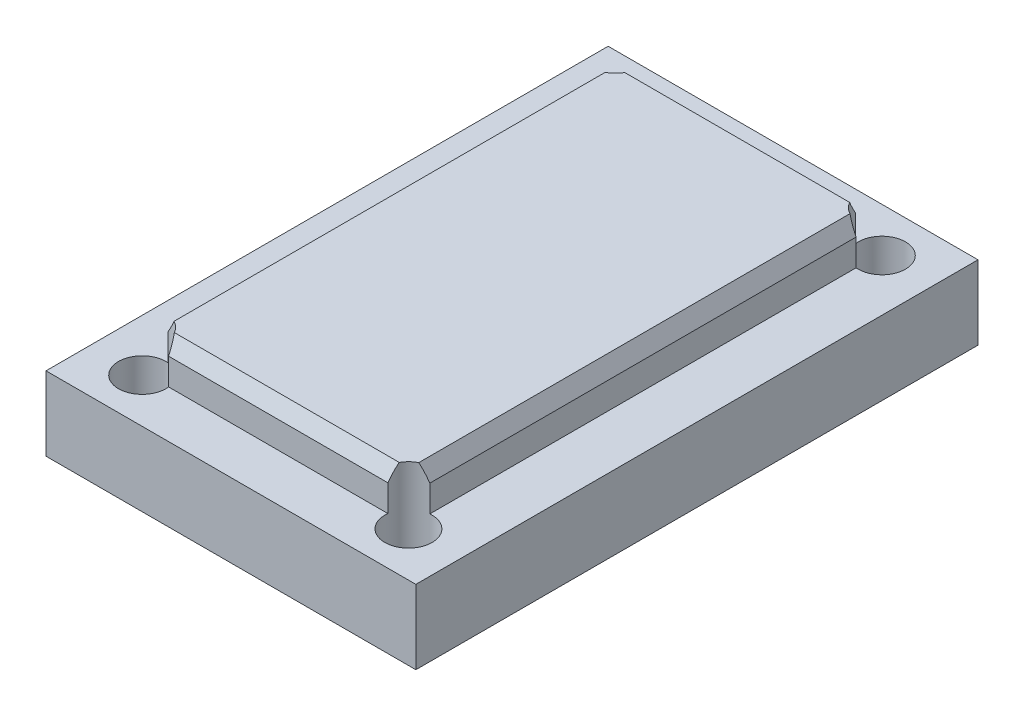
ISO-10303-21;
HEADER;
FILE_DESCRIPTION(('STEP AP214'),'2;1');
FILE_NAME('part.step','',(''),(''),'','','');
FILE_SCHEMA(('AUTOMOTIVE_DESIGN { 1 0 10303 214 1 1 1 1 }'));
ENDSEC;
DATA;
#1=APPLICATION_CONTEXT('core data for automotive mechanical design processes');
#2=APPLICATION_PROTOCOL_DEFINITION('international standard','automotive_design',2000,#1);
#3=PRODUCT_CONTEXT('',#1,'mechanical');
#4=PRODUCT('Part','Part','',(#3));
#5=PRODUCT_RELATED_PRODUCT_CATEGORY('part','',(#4));
#6=PRODUCT_DEFINITION_FORMATION('','',#4);
#7=PRODUCT_DEFINITION_CONTEXT('part definition',#1,'design');
#8=PRODUCT_DEFINITION('design','',#6,#7);
#9=PRODUCT_DEFINITION_SHAPE('','',#8);
#10=(LENGTH_UNIT() NAMED_UNIT(*) SI_UNIT(.MILLI.,.METRE.));
#11=(NAMED_UNIT(*) PLANE_ANGLE_UNIT() SI_UNIT($,.RADIAN.));
#12=(NAMED_UNIT(*) SI_UNIT($,.STERADIAN.) SOLID_ANGLE_UNIT());
#13=UNCERTAINTY_MEASURE_WITH_UNIT(LENGTH_MEASURE(1.E-05),#10,'distance_accuracy_value','');
#14=(GEOMETRIC_REPRESENTATION_CONTEXT(3) GLOBAL_UNCERTAINTY_ASSIGNED_CONTEXT((#13)) GLOBAL_UNIT_ASSIGNED_CONTEXT((#10,
#11,#12)) REPRESENTATION_CONTEXT('',''));
#15=CARTESIAN_POINT('',(0.,0.,0.));
#16=DIRECTION('',(0.,0.,1.));
#17=DIRECTION('',(1.,0.,0.));
#18=AXIS2_PLACEMENT_3D('',#15,#16,#17);
#19=CARTESIAN_POINT('',(0.,5.,0.));
#20=DIRECTION('',(0.,1.,0.));
#21=DIRECTION('',(0.,0.,1.));
#22=AXIS2_PLACEMENT_3D('',#19,#20,#21);
#23=PLANE('',#22);
#24=CARTESIAN_POINT('',(-9.,5.,16.));
#25=DIRECTION('',(0.,1.,0.));
#26=DIRECTION('',(0.,0.,1.));
#27=AXIS2_PLACEMENT_3D('',#24,#25,#26);
#28=CIRCLE('',#27,1.6);
#29=CARTESIAN_POINT('',(-8.85,5.,14.4070467677926));
#30=VERTEX_POINT('',#29);
#31=CARTESIAN_POINT('',(-7.41254921336124,5.,15.8));
#32=VERTEX_POINT('',#31);
#33=EDGE_CURVE('E283',#30,#32,#28,.T.);
#34=ORIENTED_EDGE('',*,*,#33,.F.);
#35=DIRECTION('',(0.,0.,1.));
#36=VECTOR('',#35,1.);
#37=CARTESIAN_POINT('',(-8.85,5.,-15.8));
#38=LINE('',#37,#36);
#39=CARTESIAN_POINT('',(-8.85,5.,-14.4070467677926));
#40=VERTEX_POINT('',#39);
#41=EDGE_CURVE('E300',#40,#30,#38,.T.);
#42=ORIENTED_EDGE('',*,*,#41,.F.);
#43=CARTESIAN_POINT('',(-9.,5.,-16.));
#44=DIRECTION('',(0.,1.,0.));
#45=DIRECTION('',(0.,0.,1.));
#46=AXIS2_PLACEMENT_3D('',#43,#44,#45);
#47=CIRCLE('',#46,1.6);
#48=CARTESIAN_POINT('',(-7.41254921336125,5.,-15.8));
#49=VERTEX_POINT('',#48);
#50=EDGE_CURVE('E173',#49,#40,#47,.T.);
#51=ORIENTED_EDGE('',*,*,#50,.F.);
#52=DIRECTION('',(-1.,0.,0.));
#53=VECTOR('',#52,1.);
#54=CARTESIAN_POINT('',(8.85,5.,-15.8));
#55=LINE('',#54,#53);
#56=CARTESIAN_POINT('',(7.41254921336124,5.,-15.8));
#57=VERTEX_POINT('',#56);
#58=EDGE_CURVE('E151',#57,#49,#55,.T.);
#59=ORIENTED_EDGE('',*,*,#58,.F.);
#60=CARTESIAN_POINT('',(8.99999999999999,5.,-16.));
#61=DIRECTION('',(0.,1.,0.));
#62=DIRECTION('',(0.,0.,1.));
#63=AXIS2_PLACEMENT_3D('',#60,#61,#62);
#64=CIRCLE('',#63,1.6);
#65=CARTESIAN_POINT('',(8.85,5.,-14.4070467677926));
#66=VERTEX_POINT('',#65);
#67=EDGE_CURVE('E156',#66,#57,#64,.T.);
#68=ORIENTED_EDGE('',*,*,#67,.F.);
#69=DIRECTION('',(0.,0.,-1.));
#70=VECTOR('',#69,1.);
#71=CARTESIAN_POINT('',(8.85,5.,-15.8));
#72=LINE('',#71,#70);
#73=CARTESIAN_POINT('',(8.85,5.,14.4070467677926));
#74=VERTEX_POINT('',#73);
#75=EDGE_CURVE('E175',#74,#66,#72,.T.);
#76=ORIENTED_EDGE('',*,*,#75,.F.);
#77=CARTESIAN_POINT('',(9.,5.,16.));
#78=DIRECTION('',(0.,1.,0.));
#79=DIRECTION('',(0.,0.,1.));
#80=AXIS2_PLACEMENT_3D('',#77,#78,#79);
#81=CIRCLE('',#80,1.6);
#82=CARTESIAN_POINT('',(7.41254921336124,5.,15.8));
#83=VERTEX_POINT('',#82);
#84=EDGE_CURVE('E295',#83,#74,#81,.T.);
#85=ORIENTED_EDGE('',*,*,#84,.F.);
#86=DIRECTION('',(1.,0.,0.));
#87=VECTOR('',#86,1.);
#88=CARTESIAN_POINT('',(8.85,5.,15.8));
#89=LINE('',#88,#87);
#90=EDGE_CURVE('E180',#32,#83,#89,.T.);
#91=ORIENTED_EDGE('',*,*,#90,.F.);
#92=EDGE_LOOP('',(#34,#42,#51,#59,#68,#76,#85,#91));
#93=FACE_BOUND('',#92,.T.);
#94=DIRECTION('',(0.,0.,1.));
#95=VECTOR('',#94,1.);
#96=CARTESIAN_POINT('',(-12.5,5.,19.));
#97=LINE('',#96,#95);
#98=CARTESIAN_POINT('',(-12.5,5.,-19.));
#99=VERTEX_POINT('',#98);
#100=CARTESIAN_POINT('',(-12.5,5.,19.));
#101=VERTEX_POINT('',#100);
#102=EDGE_CURVE('E184',#99,#101,#97,.T.);
#103=ORIENTED_EDGE('',*,*,#102,.T.);
#104=DIRECTION('',(1.,0.,0.));
#105=VECTOR('',#104,1.);
#106=CARTESIAN_POINT('',(12.5,5.,19.));
#107=LINE('',#106,#105);
#108=CARTESIAN_POINT('',(12.5,5.,19.));
#109=VERTEX_POINT('',#108);
#110=EDGE_CURVE('E187',#101,#109,#107,.T.);
#111=ORIENTED_EDGE('',*,*,#110,.T.);
#112=DIRECTION('',(0.,0.,-1.));
#113=VECTOR('',#112,1.);
#114=CARTESIAN_POINT('',(12.5,5.,19.));
#115=LINE('',#114,#113);
#116=CARTESIAN_POINT('',(12.5,5.,-19.));
#117=VERTEX_POINT('',#116);
#118=EDGE_CURVE('E190',#109,#117,#115,.T.);
#119=ORIENTED_EDGE('',*,*,#118,.T.);
#120=DIRECTION('',(-1.,0.,0.));
#121=VECTOR('',#120,1.);
#122=CARTESIAN_POINT('',(12.5,5.,-19.));
#123=LINE('',#122,#121);
#124=EDGE_CURVE('E192',#117,#99,#123,.T.);
#125=ORIENTED_EDGE('',*,*,#124,.T.);
#126=EDGE_LOOP('',(#103,#111,#119,#125));
#127=FACE_BOUND('',#126,.T.);
#128=ADVANCED_FACE('F34',(#93,#127),#23,.T.);
#129=CARTESIAN_POINT('',(-12.5,5.,19.));
#130=DIRECTION('',(1.,0.,0.));
#131=DIRECTION('',(0.,0.,-1.));
#132=AXIS2_PLACEMENT_3D('',#129,#130,#131);
#133=PLANE('',#132);
#134=DIRECTION('',(0.,0.,1.));
#135=VECTOR('',#134,1.);
#136=CARTESIAN_POINT('',(-12.5,0.,19.));
#137=LINE('',#136,#135);
#138=CARTESIAN_POINT('',(-12.5,0.,-19.));
#139=VERTEX_POINT('',#138);
#140=CARTESIAN_POINT('',(-12.5,0.,19.));
#141=VERTEX_POINT('',#140);
#142=EDGE_CURVE('E174',#139,#141,#137,.T.);
#143=ORIENTED_EDGE('',*,*,#142,.T.);
#144=DIRECTION('',(0.,-1.,0.));
#145=VECTOR('',#144,1.);
#146=CARTESIAN_POINT('',(-12.5,5.,19.));
#147=LINE('',#146,#145);
#148=EDGE_CURVE('E207',#101,#141,#147,.T.);
#149=ORIENTED_EDGE('',*,*,#148,.F.);
#150=ORIENTED_EDGE('',*,*,#102,.F.);
#151=DIRECTION('',(0.,-1.,0.));
#152=VECTOR('',#151,1.);
#153=CARTESIAN_POINT('',(-12.5,5.,-19.));
#154=LINE('',#153,#152);
#155=EDGE_CURVE('E193',#99,#139,#154,.T.);
#156=ORIENTED_EDGE('',*,*,#155,.T.);
#157=EDGE_LOOP('',(#143,#149,#150,#156));
#158=FACE_BOUND('',#157,.T.);
#159=ADVANCED_FACE('F327',(#158),#133,.F.);
#160=CARTESIAN_POINT('',(12.5,5.,19.));
#161=DIRECTION('',(0.,0.,-1.));
#162=DIRECTION('',(-1.,0.,0.));
#163=AXIS2_PLACEMENT_3D('',#160,#161,#162);
#164=PLANE('',#163);
#165=DIRECTION('',(1.,0.,0.));
#166=VECTOR('',#165,1.);
#167=CARTESIAN_POINT('',(12.5,0.,19.));
#168=LINE('',#167,#166);
#169=CARTESIAN_POINT('',(12.5,0.,19.));
#170=VERTEX_POINT('',#169);
#171=EDGE_CURVE('E178',#141,#170,#168,.T.);
#172=ORIENTED_EDGE('',*,*,#171,.T.);
#173=DIRECTION('',(0.,-1.,0.));
#174=VECTOR('',#173,1.);
#175=CARTESIAN_POINT('',(12.5,5.,19.));
#176=LINE('',#175,#174);
#177=EDGE_CURVE('E204',#109,#170,#176,.T.);
#178=ORIENTED_EDGE('',*,*,#177,.F.);
#179=ORIENTED_EDGE('',*,*,#110,.F.);
#180=ORIENTED_EDGE('',*,*,#148,.T.);
#181=EDGE_LOOP('',(#172,#178,#179,#180));
#182=FACE_BOUND('',#181,.T.);
#183=ADVANCED_FACE('F332',(#182),#164,.F.);
#184=CARTESIAN_POINT('',(12.5,5.,19.));
#185=DIRECTION('',(-1.,0.,0.));
#186=DIRECTION('',(0.,0.,1.));
#187=AXIS2_PLACEMENT_3D('',#184,#185,#186);
#188=PLANE('',#187);
#189=DIRECTION('',(0.,0.,-1.));
#190=VECTOR('',#189,1.);
#191=CARTESIAN_POINT('',(12.5,0.,19.));
#192=LINE('',#191,#190);
#193=CARTESIAN_POINT('',(12.5,0.,-19.));
#194=VERTEX_POINT('',#193);
#195=EDGE_CURVE('E196',#170,#194,#192,.T.);
#196=ORIENTED_EDGE('',*,*,#195,.T.);
#197=DIRECTION('',(0.,-1.,0.));
#198=VECTOR('',#197,1.);
#199=CARTESIAN_POINT('',(12.5,5.,-19.));
#200=LINE('',#199,#198);
#201=EDGE_CURVE('E201',#117,#194,#200,.T.);
#202=ORIENTED_EDGE('',*,*,#201,.F.);
#203=ORIENTED_EDGE('',*,*,#118,.F.);
#204=ORIENTED_EDGE('',*,*,#177,.T.);
#205=EDGE_LOOP('',(#196,#202,#203,#204));
#206=FACE_BOUND('',#205,.T.);
#207=ADVANCED_FACE('F345',(#206),#188,.F.);
#208=CARTESIAN_POINT('',(12.5,5.,-19.));
#209=DIRECTION('',(0.,0.,1.));
#210=DIRECTION('',(1.,0.,0.));
#211=AXIS2_PLACEMENT_3D('',#208,#209,#210);
#212=PLANE('',#211);
#213=DIRECTION('',(-1.,0.,0.));
#214=VECTOR('',#213,1.);
#215=CARTESIAN_POINT('',(12.5,0.,-19.));
#216=LINE('',#215,#214);
#217=EDGE_CURVE('E188',#194,#139,#216,.T.);
#218=ORIENTED_EDGE('',*,*,#217,.T.);
#219=ORIENTED_EDGE('',*,*,#155,.F.);
#220=ORIENTED_EDGE('',*,*,#124,.F.);
#221=ORIENTED_EDGE('',*,*,#201,.T.);
#222=EDGE_LOOP('',(#218,#219,#220,#221));
#223=FACE_BOUND('',#222,.T.);
#224=ADVANCED_FACE('F341',(#223),#212,.F.);
#225=CARTESIAN_POINT('',(0.,0.,0.));
#226=DIRECTION('',(0.,1.,0.));
#227=DIRECTION('',(0.,0.,1.));
#228=AXIS2_PLACEMENT_3D('',#225,#226,#227);
#229=PLANE('',#228);
#230=CARTESIAN_POINT('',(-9.,0.,16.));
#231=DIRECTION('',(0.,1.,0.));
#232=DIRECTION('',(0.,0.,1.));
#233=AXIS2_PLACEMENT_3D('',#230,#231,#232);
#234=CIRCLE('',#233,1.6);
#235=CARTESIAN_POINT('',(-9.,0.,17.6));
#236=VERTEX_POINT('',#235);
#237=EDGE_CURVE('E157',#236,#236,#234,.T.);
#238=ORIENTED_EDGE('',*,*,#237,.T.);
#239=EDGE_LOOP('',(#238));
#240=FACE_BOUND('',#239,.T.);
#241=CARTESIAN_POINT('',(-9.,0.,-16.));
#242=DIRECTION('',(0.,1.,0.));
#243=DIRECTION('',(0.,0.,1.));
#244=AXIS2_PLACEMENT_3D('',#241,#242,#243);
#245=CIRCLE('',#244,1.6);
#246=CARTESIAN_POINT('',(-9.,0.,-14.4));
#247=VERTEX_POINT('',#246);
#248=EDGE_CURVE('E265',#247,#247,#245,.T.);
#249=ORIENTED_EDGE('',*,*,#248,.T.);
#250=EDGE_LOOP('',(#249));
#251=FACE_BOUND('',#250,.T.);
#252=CARTESIAN_POINT('',(8.99999999999999,0.,-16.));
#253=DIRECTION('',(0.,1.,0.));
#254=DIRECTION('',(0.,0.,1.));
#255=AXIS2_PLACEMENT_3D('',#252,#253,#254);
#256=CIRCLE('',#255,1.6);
#257=CARTESIAN_POINT('',(8.99999999999999,0.,-14.4));
#258=VERTEX_POINT('',#257);
#259=EDGE_CURVE('E272',#258,#258,#256,.T.);
#260=ORIENTED_EDGE('',*,*,#259,.T.);
#261=EDGE_LOOP('',(#260));
#262=FACE_BOUND('',#261,.T.);
#263=CARTESIAN_POINT('',(9.,0.,16.));
#264=DIRECTION('',(0.,1.,0.));
#265=DIRECTION('',(0.,0.,1.));
#266=AXIS2_PLACEMENT_3D('',#263,#264,#265);
#267=CIRCLE('',#266,1.6);
#268=CARTESIAN_POINT('',(9.,0.,17.6));
#269=VERTEX_POINT('',#268);
#270=EDGE_CURVE('E290',#269,#269,#267,.T.);
#271=ORIENTED_EDGE('',*,*,#270,.T.);
#272=EDGE_LOOP('',(#271));
#273=FACE_BOUND('',#272,.T.);
#274=ORIENTED_EDGE('',*,*,#142,.F.);
#275=ORIENTED_EDGE('',*,*,#217,.F.);
#276=ORIENTED_EDGE('',*,*,#195,.F.);
#277=ORIENTED_EDGE('',*,*,#171,.F.);
#278=EDGE_LOOP('',(#274,#275,#276,#277));
#279=FACE_BOUND('',#278,.T.);
#280=ADVANCED_FACE('F338',(#240,#251,#262,#273,#279),#229,.F.);
#281=CARTESIAN_POINT('',(-8.85,7.8,-15.8));
#282=DIRECTION('',(1.,0.,0.));
#283=DIRECTION('',(0.,0.,-1.));
#284=AXIS2_PLACEMENT_3D('',#281,#282,#283);
#285=PLANE('',#284);
#286=DIRECTION('',(0.,1.,0.));
#287=VECTOR('',#286,1.);
#288=CARTESIAN_POINT('',(-8.85,0.,14.4070467677926));
#289=LINE('',#288,#287);
#290=CARTESIAN_POINT('',(-8.85,6.79999999999999,14.4070467677926));
#291=VERTEX_POINT('',#290);
#292=EDGE_CURVE('E245',#30,#291,#289,.T.);
#293=ORIENTED_EDGE('',*,*,#292,.T.);
#294=DIRECTION('',(0.,0.,-1.));
#295=VECTOR('',#294,1.);
#296=CARTESIAN_POINT('',(-8.85,6.79999999999999,-15.8));
#297=LINE('',#296,#295);
#298=CARTESIAN_POINT('',(-8.85,6.79999999999999,-14.4070467677926));
#299=VERTEX_POINT('',#298);
#300=EDGE_CURVE('E42',#291,#299,#297,.T.);
#301=ORIENTED_EDGE('',*,*,#300,.T.);
#302=DIRECTION('',(0.,1.,0.));
#303=VECTOR('',#302,1.);
#304=CARTESIAN_POINT('',(-8.85,0.,-14.4070467677926));
#305=LINE('',#304,#303);
#306=EDGE_CURVE('E244',#299,#40,#305,.F.);
#307=ORIENTED_EDGE('',*,*,#306,.T.);
#308=ORIENTED_EDGE('',*,*,#41,.T.);
#309=EDGE_LOOP('',(#293,#301,#307,#308));
#310=FACE_BOUND('',#309,.T.);
#311=ADVANCED_FACE('F242',(#310),#285,.F.);
#312=CARTESIAN_POINT('',(8.85,7.8,15.8));
#313=DIRECTION('',(0.,0.,-1.));
#314=DIRECTION('',(-1.,0.,0.));
#315=AXIS2_PLACEMENT_3D('',#312,#313,#314);
#316=PLANE('',#315);
#317=DIRECTION('',(0.,1.,0.));
#318=VECTOR('',#317,1.);
#319=CARTESIAN_POINT('',(7.41254921336124,0.,15.8));
#320=LINE('',#319,#318);
#321=CARTESIAN_POINT('',(7.41254921336124,6.8,15.8));
#322=VERTEX_POINT('',#321);
#323=EDGE_CURVE('E298',#83,#322,#320,.T.);
#324=ORIENTED_EDGE('',*,*,#323,.T.);
#325=DIRECTION('',(-1.,0.,0.));
#326=VECTOR('',#325,1.);
#327=CARTESIAN_POINT('',(8.85,6.8,15.8));
#328=LINE('',#327,#326);
#329=CARTESIAN_POINT('',(-7.41254921336124,6.8,15.8));
#330=VERTEX_POINT('',#329);
#331=EDGE_CURVE('E11',#322,#330,#328,.T.);
#332=ORIENTED_EDGE('',*,*,#331,.T.);
#333=DIRECTION('',(0.,1.,0.));
#334=VECTOR('',#333,1.);
#335=CARTESIAN_POINT('',(-7.41254921336124,0.,15.8));
#336=LINE('',#335,#334);
#337=EDGE_CURVE('E252',#330,#32,#336,.F.);
#338=ORIENTED_EDGE('',*,*,#337,.T.);
#339=ORIENTED_EDGE('',*,*,#90,.T.);
#340=EDGE_LOOP('',(#324,#332,#338,#339));
#341=FACE_BOUND('',#340,.T.);
#342=ADVANCED_FACE('F303',(#341),#316,.F.);
#343=CARTESIAN_POINT('',(8.85,7.8,-15.8));
#344=DIRECTION('',(-1.,0.,0.));
#345=DIRECTION('',(0.,0.,1.));
#346=AXIS2_PLACEMENT_3D('',#343,#344,#345);
#347=PLANE('',#346);
#348=DIRECTION('',(0.,1.,0.));
#349=VECTOR('',#348,1.);
#350=CARTESIAN_POINT('',(8.85,0.,-14.4070467677926));
#351=LINE('',#350,#349);
#352=CARTESIAN_POINT('',(8.85,6.8,-14.4070467677926));
#353=VERTEX_POINT('',#352);
#354=EDGE_CURVE('E163',#66,#353,#351,.T.);
#355=ORIENTED_EDGE('',*,*,#354,.T.);
#356=DIRECTION('',(0.,0.,1.));
#357=VECTOR('',#356,1.);
#358=CARTESIAN_POINT('',(8.85,6.8,-15.8));
#359=LINE('',#358,#357);
#360=CARTESIAN_POINT('',(8.85,6.8,14.4070467677926));
#361=VERTEX_POINT('',#360);
#362=EDGE_CURVE('E226',#353,#361,#359,.T.);
#363=ORIENTED_EDGE('',*,*,#362,.T.);
#364=DIRECTION('',(0.,1.,0.));
#365=VECTOR('',#364,1.);
#366=CARTESIAN_POINT('',(8.85,0.,14.4070467677926));
#367=LINE('',#366,#365);
#368=EDGE_CURVE('E293',#361,#74,#367,.F.);
#369=ORIENTED_EDGE('',*,*,#368,.T.);
#370=ORIENTED_EDGE('',*,*,#75,.T.);
#371=EDGE_LOOP('',(#355,#363,#369,#370));
#372=FACE_BOUND('',#371,.T.);
#373=ADVANCED_FACE('F309',(#372),#347,.F.);
#374=CARTESIAN_POINT('',(8.85,7.8,-15.8));
#375=DIRECTION('',(0.,0.,1.));
#376=DIRECTION('',(1.,0.,0.));
#377=AXIS2_PLACEMENT_3D('',#374,#375,#376);
#378=PLANE('',#377);
#379=DIRECTION('',(0.,1.,0.));
#380=VECTOR('',#379,1.);
#381=CARTESIAN_POINT('',(-7.41254921336125,0.,-15.8));
#382=LINE('',#381,#380);
#383=CARTESIAN_POINT('',(-7.41254921336125,6.8,-15.8));
#384=VERTEX_POINT('',#383);
#385=EDGE_CURVE('E279',#49,#384,#382,.T.);
#386=ORIENTED_EDGE('',*,*,#385,.T.);
#387=DIRECTION('',(1.,0.,0.));
#388=VECTOR('',#387,1.);
#389=CARTESIAN_POINT('',(8.85,6.8,-15.8));
#390=LINE('',#389,#388);
#391=CARTESIAN_POINT('',(7.41254921336124,6.8,-15.8));
#392=VERTEX_POINT('',#391);
#393=EDGE_CURVE('E153',#384,#392,#390,.T.);
#394=ORIENTED_EDGE('',*,*,#393,.T.);
#395=DIRECTION('',(0.,1.,0.));
#396=VECTOR('',#395,1.);
#397=CARTESIAN_POINT('',(7.41254921336124,0.,-15.8));
#398=LINE('',#397,#396);
#399=EDGE_CURVE('E146',#392,#57,#398,.F.);
#400=ORIENTED_EDGE('',*,*,#399,.T.);
#401=ORIENTED_EDGE('',*,*,#58,.T.);
#402=EDGE_LOOP('',(#386,#394,#400,#401));
#403=FACE_BOUND('',#402,.T.);
#404=ADVANCED_FACE('F149',(#403),#378,.F.);
#405=CARTESIAN_POINT('',(0.,7.8,0.));
#406=DIRECTION('',(0.,-1.,0.));
#407=DIRECTION('',(0.,0.,-1.));
#408=AXIS2_PLACEMENT_3D('',#405,#406,#407);
#409=PLANE('',#408);
#410=CARTESIAN_POINT('',(9.,7.8,16.));
#411=DIRECTION('',(0.,1.,0.));
#412=DIRECTION('',(0.,0.,1.));
#413=AXIS2_PLACEMENT_3D('',#410,#411,#412);
#414=CIRCLE('',#413,1.6);
#415=CARTESIAN_POINT('',(8.27264973081038,7.8,14.5748819045743));
#416=VERTEX_POINT('',#415);
#417=CARTESIAN_POINT('',(7.60152706175956,7.8,15.2226497308104));
#418=VERTEX_POINT('',#417);
#419=EDGE_CURVE('E287',#416,#418,#414,.T.);
#420=ORIENTED_EDGE('',*,*,#419,.F.);
#421=DIRECTION('',(0.,0.,-1.));
#422=VECTOR('',#421,1.);
#423=CARTESIAN_POINT('',(8.27264973081038,7.8,0.));
#424=LINE('',#423,#422);
#425=CARTESIAN_POINT('',(8.27264973081037,7.8,-14.5748819045743));
#426=VERTEX_POINT('',#425);
#427=EDGE_CURVE('E219',#416,#426,#424,.T.);
#428=ORIENTED_EDGE('',*,*,#427,.T.);
#429=CARTESIAN_POINT('',(8.99999999999999,7.8,-16.));
#430=DIRECTION('',(0.,1.,0.));
#431=DIRECTION('',(0.,0.,1.));
#432=AXIS2_PLACEMENT_3D('',#429,#430,#431);
#433=CIRCLE('',#432,1.6);
#434=CARTESIAN_POINT('',(7.60152706175957,7.8,-15.2226497308104));
#435=VERTEX_POINT('',#434);
#436=EDGE_CURVE('E274',#435,#426,#433,.T.);
#437=ORIENTED_EDGE('',*,*,#436,.F.);
#438=DIRECTION('',(-1.,0.,0.));
#439=VECTOR('',#438,1.);
#440=CARTESIAN_POINT('',(0.,7.8,-15.2226497308104));
#441=LINE('',#440,#439);
#442=CARTESIAN_POINT('',(-7.60152706175957,7.8,-15.2226497308104));
#443=VERTEX_POINT('',#442);
#444=EDGE_CURVE('E216',#435,#443,#441,.T.);
#445=ORIENTED_EDGE('',*,*,#444,.T.);
#446=CARTESIAN_POINT('',(-9.,7.8,-16.));
#447=DIRECTION('',(0.,1.,0.));
#448=DIRECTION('',(0.,0.,1.));
#449=AXIS2_PLACEMENT_3D('',#446,#447,#448);
#450=CIRCLE('',#449,1.6);
#451=CARTESIAN_POINT('',(-8.27264973081037,7.8,-14.5748819045743));
#452=VERTEX_POINT('',#451);
#453=EDGE_CURVE('E262',#452,#443,#450,.T.);
#454=ORIENTED_EDGE('',*,*,#453,.F.);
#455=DIRECTION('',(0.,0.,1.));
#456=VECTOR('',#455,1.);
#457=CARTESIAN_POINT('',(-8.27264973081037,7.8,0.));
#458=LINE('',#457,#456);
#459=CARTESIAN_POINT('',(-8.27264973081037,7.8,14.5748819045743));
#460=VERTEX_POINT('',#459);
#461=EDGE_CURVE('E213',#452,#460,#458,.T.);
#462=ORIENTED_EDGE('',*,*,#461,.T.);
#463=CARTESIAN_POINT('',(-9.,7.8,16.));
#464=DIRECTION('',(0.,1.,0.));
#465=DIRECTION('',(0.,0.,1.));
#466=AXIS2_PLACEMENT_3D('',#463,#464,#465);
#467=CIRCLE('',#466,1.6);
#468=CARTESIAN_POINT('',(-7.60152706175956,7.8,15.2226497308104));
#469=VERTEX_POINT('',#468);
#470=EDGE_CURVE('E260',#469,#460,#467,.T.);
#471=ORIENTED_EDGE('',*,*,#470,.F.);
#472=DIRECTION('',(1.,0.,0.));
#473=VECTOR('',#472,1.);
#474=CARTESIAN_POINT('',(0.,7.8,15.2226497308104));
#475=LINE('',#474,#473);
#476=EDGE_CURVE('E210',#469,#418,#475,.T.);
#477=ORIENTED_EDGE('',*,*,#476,.T.);
#478=EDGE_LOOP('',(#420,#428,#437,#445,#454,#462,#471,#477));
#479=FACE_BOUND('',#478,.T.);
#480=ADVANCED_FACE('F259',(#479),#409,.F.);
#481=CARTESIAN_POINT('',(9.,0.,16.));
#482=DIRECTION('',(0.,1.,0.));
#483=DIRECTION('',(0.,0.,1.));
#484=AXIS2_PLACEMENT_3D('',#481,#482,#483);
#485=CYLINDRICAL_SURFACE('',#484,1.6);
#486=ORIENTED_EDGE('',*,*,#270,.F.);
#487=EDGE_LOOP('',(#486));
#488=FACE_BOUND('',#487,.T.);
#489=ORIENTED_EDGE('',*,*,#368,.F.);
#490=CARTESIAN_POINT('',(9.,6.54019237886467,16.));
#491=DIRECTION('',(-0.86602540378444,-0.499999999999998,0.));
#492=DIRECTION('',(-0.499999999999998,0.86602540378444,0.));
#493=AXIS2_PLACEMENT_3D('',#490,#491,#492);
#494=ELLIPSE('',#493,3.20000000000002,1.6);
#495=EDGE_CURVE('E230',#361,#416,#494,.F.);
#496=ORIENTED_EDGE('',*,*,#495,.T.);
#497=ORIENTED_EDGE('',*,*,#419,.T.);
#498=CARTESIAN_POINT('',(9.,6.45358983848623,16.));
#499=DIRECTION('',(0.,-0.499999999999998,-0.86602540378444));
#500=DIRECTION('',(0.,0.86602540378444,-0.499999999999998));
#501=AXIS2_PLACEMENT_3D('',#498,#499,#500);
#502=ELLIPSE('',#501,3.20000000000002,1.6);
#503=EDGE_CURVE('E228',#418,#322,#502,.F.);
#504=ORIENTED_EDGE('',*,*,#503,.T.);
#505=ORIENTED_EDGE('',*,*,#323,.F.);
#506=ORIENTED_EDGE('',*,*,#84,.T.);
#507=EDGE_LOOP('',(#489,#496,#497,#504,#505,#506));
#508=FACE_BOUND('',#507,.T.);
#509=ADVANCED_FACE('F307',(#488,#508),#485,.F.);
#510=CARTESIAN_POINT('',(8.99999999999999,0.,-16.));
#511=DIRECTION('',(0.,1.,0.));
#512=DIRECTION('',(0.,0.,1.));
#513=AXIS2_PLACEMENT_3D('',#510,#511,#512);
#514=CYLINDRICAL_SURFACE('',#513,1.6);
#515=ORIENTED_EDGE('',*,*,#259,.F.);
#516=EDGE_LOOP('',(#515));
#517=FACE_BOUND('',#516,.T.);
#518=ORIENTED_EDGE('',*,*,#436,.T.);
#519=CARTESIAN_POINT('',(8.99999999999999,6.54019237886467,-16.));
#520=DIRECTION('',(-0.86602540378444,-0.499999999999998,0.));
#521=DIRECTION('',(-0.499999999999998,0.86602540378444,0.));
#522=AXIS2_PLACEMENT_3D('',#519,#520,#521);
#523=ELLIPSE('',#522,3.20000000000002,1.6);
#524=EDGE_CURVE('E224',#426,#353,#523,.F.);
#525=ORIENTED_EDGE('',*,*,#524,.T.);
#526=ORIENTED_EDGE('',*,*,#354,.F.);
#527=ORIENTED_EDGE('',*,*,#67,.T.);
#528=ORIENTED_EDGE('',*,*,#399,.F.);
#529=CARTESIAN_POINT('',(8.99999999999999,6.45358983848622,-16.));
#530=DIRECTION('',(0.,-0.5,0.866025403784439));
#531=DIRECTION('',(0.,0.866025403784439,0.5));
#532=AXIS2_PLACEMENT_3D('',#529,#530,#531);
#533=ELLIPSE('',#532,3.2,1.6);
#534=EDGE_CURVE('E222',#392,#435,#533,.F.);
#535=ORIENTED_EDGE('',*,*,#534,.T.);
#536=EDGE_LOOP('',(#518,#525,#526,#527,#528,#535));
#537=FACE_BOUND('',#536,.T.);
#538=ADVANCED_FACE('F161',(#517,#537),#514,.F.);
#539=CARTESIAN_POINT('',(-9.,0.,-16.));
#540=DIRECTION('',(0.,1.,0.));
#541=DIRECTION('',(0.,0.,1.));
#542=AXIS2_PLACEMENT_3D('',#539,#540,#541);
#543=CYLINDRICAL_SURFACE('',#542,1.6);
#544=ORIENTED_EDGE('',*,*,#248,.F.);
#545=EDGE_LOOP('',(#544));
#546=FACE_BOUND('',#545,.T.);
#547=ORIENTED_EDGE('',*,*,#453,.T.);
#548=CARTESIAN_POINT('',(-9.,6.45358983848621,-16.));
#549=DIRECTION('',(0.,-0.5,0.866025403784439));
#550=DIRECTION('',(0.,0.866025403784439,0.5));
#551=AXIS2_PLACEMENT_3D('',#548,#549,#550);
#552=ELLIPSE('',#551,3.2,1.6);
#553=EDGE_CURVE('E234',#443,#384,#552,.F.);
#554=ORIENTED_EDGE('',*,*,#553,.T.);
#555=ORIENTED_EDGE('',*,*,#385,.F.);
#556=ORIENTED_EDGE('',*,*,#50,.T.);
#557=ORIENTED_EDGE('',*,*,#306,.F.);
#558=CARTESIAN_POINT('',(-9.,6.54019237886466,-16.));
#559=DIRECTION('',(0.866025403784439,-0.5,0.));
#560=DIRECTION('',(0.5,0.866025403784439,0.));
#561=AXIS2_PLACEMENT_3D('',#558,#559,#560);
#562=ELLIPSE('',#561,3.20000000000001,1.6);
#563=EDGE_CURVE('E232',#299,#452,#562,.F.);
#564=ORIENTED_EDGE('',*,*,#563,.T.);
#565=EDGE_LOOP('',(#547,#554,#555,#556,#557,#564));
#566=FACE_BOUND('',#565,.T.);
#567=ADVANCED_FACE('F250',(#546,#566),#543,.F.);
#568=CARTESIAN_POINT('',(-9.,0.,16.));
#569=DIRECTION('',(0.,1.,0.));
#570=DIRECTION('',(0.,0.,1.));
#571=AXIS2_PLACEMENT_3D('',#568,#569,#570);
#572=CYLINDRICAL_SURFACE('',#571,1.6);
#573=ORIENTED_EDGE('',*,*,#237,.F.);
#574=EDGE_LOOP('',(#573));
#575=FACE_BOUND('',#574,.T.);
#576=ORIENTED_EDGE('',*,*,#470,.T.);
#577=CARTESIAN_POINT('',(-9.,6.54019237886466,16.));
#578=DIRECTION('',(0.866025403784439,-0.5,0.));
#579=DIRECTION('',(0.5,0.866025403784439,0.));
#580=AXIS2_PLACEMENT_3D('',#577,#578,#579);
#581=ELLIPSE('',#580,3.20000000000001,1.6);
#582=EDGE_CURVE('E49',#460,#291,#581,.F.);
#583=ORIENTED_EDGE('',*,*,#582,.T.);
#584=ORIENTED_EDGE('',*,*,#292,.F.);
#585=ORIENTED_EDGE('',*,*,#33,.T.);
#586=ORIENTED_EDGE('',*,*,#337,.F.);
#587=CARTESIAN_POINT('',(-9.,6.45358983848624,16.));
#588=DIRECTION('',(0.,-0.499999999999998,-0.86602540378444));
#589=DIRECTION('',(0.,0.86602540378444,-0.499999999999998));
#590=AXIS2_PLACEMENT_3D('',#587,#588,#589);
#591=ELLIPSE('',#590,3.20000000000002,1.6);
#592=EDGE_CURVE('E237',#330,#469,#591,.F.);
#593=ORIENTED_EDGE('',*,*,#592,.T.);
#594=EDGE_LOOP('',(#576,#583,#584,#585,#586,#593));
#595=FACE_BOUND('',#594,.T.);
#596=ADVANCED_FACE('F263',(#575,#595),#572,.F.);
#597=CARTESIAN_POINT('',(8.27264973081038,7.8,0.));
#598=DIRECTION('',(-0.86602540378444,-0.499999999999998,0.));
#599=DIRECTION('',(0.,0.,-1.));
#600=AXIS2_PLACEMENT_3D('',#597,#598,#599);
#601=PLANE('',#600);
#602=ORIENTED_EDGE('',*,*,#495,.F.);
#603=ORIENTED_EDGE('',*,*,#362,.F.);
#604=ORIENTED_EDGE('',*,*,#524,.F.);
#605=ORIENTED_EDGE('',*,*,#427,.F.);
#606=EDGE_LOOP('',(#602,#603,#604,#605));
#607=FACE_BOUND('',#606,.T.);
#608=ADVANCED_FACE('F314',(#607),#601,.F.);
#609=CARTESIAN_POINT('',(0.,7.8,-15.2226497308104));
#610=DIRECTION('',(0.,-0.5,0.866025403784439));
#611=DIRECTION('',(-1.,0.,0.));
#612=AXIS2_PLACEMENT_3D('',#609,#610,#611);
#613=PLANE('',#612);
#614=ORIENTED_EDGE('',*,*,#534,.F.);
#615=ORIENTED_EDGE('',*,*,#393,.F.);
#616=ORIENTED_EDGE('',*,*,#553,.F.);
#617=ORIENTED_EDGE('',*,*,#444,.F.);
#618=EDGE_LOOP('',(#614,#615,#616,#617));
#619=FACE_BOUND('',#618,.T.);
#620=ADVANCED_FACE('F318',(#619),#613,.F.);
#621=CARTESIAN_POINT('',(-8.27264973081037,7.8,0.));
#622=DIRECTION('',(0.866025403784439,-0.5,0.));
#623=DIRECTION('',(0.,0.,1.));
#624=AXIS2_PLACEMENT_3D('',#621,#622,#623);
#625=PLANE('',#624);
#626=ORIENTED_EDGE('',*,*,#563,.F.);
#627=ORIENTED_EDGE('',*,*,#300,.F.);
#628=ORIENTED_EDGE('',*,*,#582,.F.);
#629=ORIENTED_EDGE('',*,*,#461,.F.);
#630=EDGE_LOOP('',(#626,#627,#628,#629));
#631=FACE_BOUND('',#630,.T.);
#632=ADVANCED_FACE('F255',(#631),#625,.F.);
#633=CARTESIAN_POINT('',(0.,7.8,15.2226497308104));
#634=DIRECTION('',(0.,-0.499999999999998,-0.86602540378444));
#635=DIRECTION('',(1.,0.,0.));
#636=AXIS2_PLACEMENT_3D('',#633,#634,#635);
#637=PLANE('',#636);
#638=ORIENTED_EDGE('',*,*,#592,.F.);
#639=ORIENTED_EDGE('',*,*,#331,.F.);
#640=ORIENTED_EDGE('',*,*,#503,.F.);
#641=ORIENTED_EDGE('',*,*,#476,.F.);
#642=EDGE_LOOP('',(#638,#639,#640,#641));
#643=FACE_BOUND('',#642,.T.);
#644=ADVANCED_FACE('F36',(#643),#637,.F.);
#645=CLOSED_SHELL('',(#128,#159,#183,#207,#224,#280,#311,#342,#373,#404,#480,#509,#538,#567,
#596,#608,#620,#632,#644));
#646=MANIFOLD_SOLID_BREP('B2',#645);
#647=ADVANCED_BREP_SHAPE_REPRESENTATION('',(#18,#646),#14);
#648=SHAPE_DEFINITION_REPRESENTATION(#9,#647);
ENDSEC;
END-ISO-10303-21;
